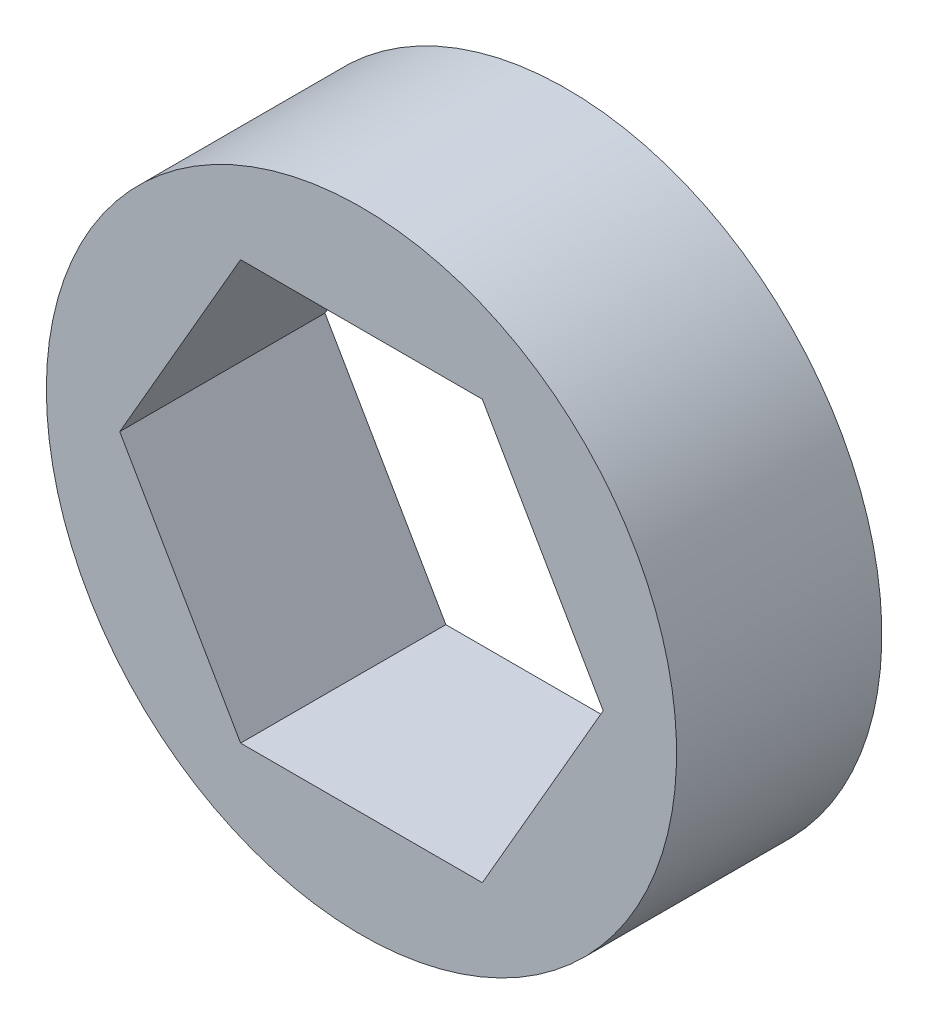
ISO-10303-21;
HEADER;
FILE_DESCRIPTION(('STEP AP214'),'2;1');
FILE_NAME('part.step','',(''),(''),'','','');
FILE_SCHEMA(('AUTOMOTIVE_DESIGN { 1 0 10303 214 1 1 1 1 }'));
ENDSEC;
DATA;
#1=APPLICATION_CONTEXT('core data for automotive mechanical design processes');
#2=APPLICATION_PROTOCOL_DEFINITION('international standard','automotive_design',2000,#1);
#3=PRODUCT_CONTEXT('',#1,'mechanical');
#4=PRODUCT('Part','Part','',(#3));
#5=PRODUCT_RELATED_PRODUCT_CATEGORY('part','',(#4));
#6=PRODUCT_DEFINITION_FORMATION('','',#4);
#7=PRODUCT_DEFINITION_CONTEXT('part definition',#1,'design');
#8=PRODUCT_DEFINITION('design','',#6,#7);
#9=PRODUCT_DEFINITION_SHAPE('','',#8);
#10=(LENGTH_UNIT() NAMED_UNIT(*) SI_UNIT(.MILLI.,.METRE.));
#11=(NAMED_UNIT(*) PLANE_ANGLE_UNIT() SI_UNIT($,.RADIAN.));
#12=(NAMED_UNIT(*) SI_UNIT($,.STERADIAN.) SOLID_ANGLE_UNIT());
#13=UNCERTAINTY_MEASURE_WITH_UNIT(LENGTH_MEASURE(1.E-05),#10,'distance_accuracy_value','');
#14=(GEOMETRIC_REPRESENTATION_CONTEXT(3) GLOBAL_UNCERTAINTY_ASSIGNED_CONTEXT((#13)) GLOBAL_UNIT_ASSIGNED_CONTEXT((#10,
#11,#12)) REPRESENTATION_CONTEXT('',''));
#15=CARTESIAN_POINT('',(0.,0.,0.));
#16=DIRECTION('',(0.,0.,1.));
#17=DIRECTION('',(1.,0.,0.));
#18=AXIS2_PLACEMENT_3D('',#15,#16,#17);
#19=CARTESIAN_POINT('',(-7.47899538708241,0.,3.175));
#20=DIRECTION('',(0.866025403784439,0.5,0.));
#21=DIRECTION('',(-0.5,0.866025403784439,0.));
#22=AXIS2_PLACEMENT_3D('',#19,#20,#21);
#23=PLANE('',#22);
#24=DIRECTION('',(-0.5,0.866025403784438,0.));
#25=VECTOR('',#24,1.);
#26=CARTESIAN_POINT('',(-3.73949769354121,-6.477,3.175));
#27=LINE('',#26,#25);
#28=CARTESIAN_POINT('',(-3.73949769354121,-6.477,3.175));
#29=VERTEX_POINT('',#28);
#30=CARTESIAN_POINT('',(-7.47899538708241,0.,3.175));
#31=VERTEX_POINT('',#30);
#32=EDGE_CURVE('E83',#29,#31,#27,.T.);
#33=ORIENTED_EDGE('',*,*,#32,.F.);
#34=DIRECTION('',(0.,0.,1.));
#35=VECTOR('',#34,1.);
#36=CARTESIAN_POINT('',(-3.73949769354121,-6.477,3.175));
#37=LINE('',#36,#35);
#38=CARTESIAN_POINT('',(-3.73949769354121,-6.477,-3.175));
#39=VERTEX_POINT('',#38);
#40=EDGE_CURVE('E75',#39,#29,#37,.T.);
#41=ORIENTED_EDGE('',*,*,#40,.F.);
#42=DIRECTION('',(-0.5,0.866025403784439,0.));
#43=VECTOR('',#42,1.);
#44=CARTESIAN_POINT('',(-3.73949769354121,-6.477,-3.175));
#45=LINE('',#44,#43);
#46=CARTESIAN_POINT('',(-7.47899538708241,0.,-3.175));
#47=VERTEX_POINT('',#46);
#48=EDGE_CURVE('E115',#39,#47,#45,.T.);
#49=ORIENTED_EDGE('',*,*,#48,.T.);
#50=DIRECTION('',(0.,0.,1.));
#51=VECTOR('',#50,1.);
#52=CARTESIAN_POINT('',(-7.47899538708241,0.,3.175));
#53=LINE('',#52,#51);
#54=EDGE_CURVE('E100',#31,#47,#53,.F.);
#55=ORIENTED_EDGE('',*,*,#54,.F.);
#56=EDGE_LOOP('',(#33,#41,#49,#55));
#57=FACE_BOUND('',#56,.T.);
#58=ADVANCED_FACE('F16',(#57),#23,.T.);
#59=CARTESIAN_POINT('',(-3.73949769354121,6.477,3.175));
#60=DIRECTION('',(0.866025403784439,-0.5,0.));
#61=DIRECTION('',(0.5,0.866025403784439,0.));
#62=AXIS2_PLACEMENT_3D('',#59,#60,#61);
#63=PLANE('',#62);
#64=DIRECTION('',(0.5,0.866025403784439,0.));
#65=VECTOR('',#64,1.);
#66=CARTESIAN_POINT('',(-7.47899538708242,0.,3.175));
#67=LINE('',#66,#65);
#68=CARTESIAN_POINT('',(-3.73949769354121,6.477,3.175));
#69=VERTEX_POINT('',#68);
#70=EDGE_CURVE('E108',#31,#69,#67,.T.);
#71=ORIENTED_EDGE('',*,*,#70,.F.);
#72=ORIENTED_EDGE('',*,*,#54,.T.);
#73=DIRECTION('',(0.5,0.866025403784439,0.));
#74=VECTOR('',#73,1.);
#75=CARTESIAN_POINT('',(-7.47899538708241,0.,-3.175));
#76=LINE('',#75,#74);
#77=CARTESIAN_POINT('',(-3.73949769354121,6.477,-3.175));
#78=VERTEX_POINT('',#77);
#79=EDGE_CURVE('E106',#47,#78,#76,.T.);
#80=ORIENTED_EDGE('',*,*,#79,.T.);
#81=DIRECTION('',(0.,0.,1.));
#82=VECTOR('',#81,1.);
#83=CARTESIAN_POINT('',(-3.73949769354121,6.477,3.175));
#84=LINE('',#83,#82);
#85=EDGE_CURVE('E97',#69,#78,#84,.F.);
#86=ORIENTED_EDGE('',*,*,#85,.F.);
#87=EDGE_LOOP('',(#71,#72,#80,#86));
#88=FACE_BOUND('',#87,.T.);
#89=ADVANCED_FACE('F105',(#88),#63,.T.);
#90=CARTESIAN_POINT('',(3.7394976935412,6.477,3.175));
#91=DIRECTION('',(0.,-1.,0.));
#92=DIRECTION('',(1.,0.,0.));
#93=AXIS2_PLACEMENT_3D('',#90,#91,#92);
#94=PLANE('',#93);
#95=DIRECTION('',(1.,0.,0.));
#96=VECTOR('',#95,1.);
#97=CARTESIAN_POINT('',(0.,6.477,3.175));
#98=LINE('',#97,#96);
#99=CARTESIAN_POINT('',(3.7394976935412,6.477,3.175));
#100=VERTEX_POINT('',#99);
#101=EDGE_CURVE('E125',#69,#100,#98,.T.);
#102=ORIENTED_EDGE('',*,*,#101,.F.);
#103=ORIENTED_EDGE('',*,*,#85,.T.);
#104=DIRECTION('',(1.,0.,0.));
#105=VECTOR('',#104,1.);
#106=CARTESIAN_POINT('',(0.,6.477,-3.175));
#107=LINE('',#106,#105);
#108=CARTESIAN_POINT('',(3.7394976935412,6.477,-3.175));
#109=VERTEX_POINT('',#108);
#110=EDGE_CURVE('E117',#78,#109,#107,.T.);
#111=ORIENTED_EDGE('',*,*,#110,.T.);
#112=DIRECTION('',(0.,0.,1.));
#113=VECTOR('',#112,1.);
#114=CARTESIAN_POINT('',(3.7394976935412,6.47700000000001,3.175));
#115=LINE('',#114,#113);
#116=EDGE_CURVE('E94',#100,#109,#115,.F.);
#117=ORIENTED_EDGE('',*,*,#116,.F.);
#118=EDGE_LOOP('',(#102,#103,#111,#117));
#119=FACE_BOUND('',#118,.T.);
#120=ADVANCED_FACE('F134',(#119),#94,.T.);
#121=CARTESIAN_POINT('',(7.47899538708241,0.,3.175));
#122=DIRECTION('',(-0.866025403784439,-0.5,0.));
#123=DIRECTION('',(0.5,-0.866025403784439,0.));
#124=AXIS2_PLACEMENT_3D('',#121,#122,#123);
#125=PLANE('',#124);
#126=DIRECTION('',(0.5,-0.866025403784438,0.));
#127=VECTOR('',#126,1.);
#128=CARTESIAN_POINT('',(3.7394976935412,6.477,3.175));
#129=LINE('',#128,#127);
#130=CARTESIAN_POINT('',(7.47899538708242,0.,3.175));
#131=VERTEX_POINT('',#130);
#132=EDGE_CURVE('E88',#100,#131,#129,.T.);
#133=ORIENTED_EDGE('',*,*,#132,.F.);
#134=ORIENTED_EDGE('',*,*,#116,.T.);
#135=DIRECTION('',(0.5,-0.866025403784438,0.));
#136=VECTOR('',#135,1.);
#137=CARTESIAN_POINT('',(3.7394976935412,6.477,-3.175));
#138=LINE('',#137,#136);
#139=CARTESIAN_POINT('',(7.47899538708241,0.,-3.175));
#140=VERTEX_POINT('',#139);
#141=EDGE_CURVE('E119',#109,#140,#138,.T.);
#142=ORIENTED_EDGE('',*,*,#141,.T.);
#143=DIRECTION('',(0.,0.,1.));
#144=VECTOR('',#143,1.);
#145=CARTESIAN_POINT('',(7.47899538708242,0.,3.175));
#146=LINE('',#145,#144);
#147=EDGE_CURVE('E64',#131,#140,#146,.F.);
#148=ORIENTED_EDGE('',*,*,#147,.F.);
#149=EDGE_LOOP('',(#133,#134,#142,#148));
#150=FACE_BOUND('',#149,.T.);
#151=ADVANCED_FACE('F131',(#150),#125,.T.);
#152=CARTESIAN_POINT('',(3.73949769354121,-6.477,3.175));
#153=DIRECTION('',(-0.866025403784439,0.5,0.));
#154=DIRECTION('',(-0.5,-0.866025403784439,0.));
#155=AXIS2_PLACEMENT_3D('',#152,#153,#154);
#156=PLANE('',#155);
#157=DIRECTION('',(-0.5,-0.866025403784439,0.));
#158=VECTOR('',#157,1.);
#159=CARTESIAN_POINT('',(7.47899538708241,0.,3.175));
#160=LINE('',#159,#158);
#161=CARTESIAN_POINT('',(3.73949769354121,-6.477,3.175));
#162=VERTEX_POINT('',#161);
#163=EDGE_CURVE('E70',#131,#162,#160,.T.);
#164=ORIENTED_EDGE('',*,*,#163,.F.);
#165=ORIENTED_EDGE('',*,*,#147,.T.);
#166=DIRECTION('',(-0.5,-0.866025403784439,0.));
#167=VECTOR('',#166,1.);
#168=CARTESIAN_POINT('',(7.47899538708241,0.,-3.175));
#169=LINE('',#168,#167);
#170=CARTESIAN_POINT('',(3.73949769354121,-6.477,-3.175));
#171=VERTEX_POINT('',#170);
#172=EDGE_CURVE('E32',#140,#171,#169,.T.);
#173=ORIENTED_EDGE('',*,*,#172,.T.);
#174=DIRECTION('',(0.,0.,1.));
#175=VECTOR('',#174,1.);
#176=CARTESIAN_POINT('',(3.73949769354121,-6.477,3.175));
#177=LINE('',#176,#175);
#178=EDGE_CURVE('E66',#162,#171,#177,.F.);
#179=ORIENTED_EDGE('',*,*,#178,.F.);
#180=EDGE_LOOP('',(#164,#165,#173,#179));
#181=FACE_BOUND('',#180,.T.);
#182=ADVANCED_FACE('F68',(#181),#156,.T.);
#183=CARTESIAN_POINT('',(-3.73949769354121,-6.477,3.175));
#184=DIRECTION('',(0.,1.,0.));
#185=DIRECTION('',(0.,0.,1.));
#186=AXIS2_PLACEMENT_3D('',#183,#184,#185);
#187=PLANE('',#186);
#188=DIRECTION('',(1.,0.,0.));
#189=VECTOR('',#188,1.);
#190=CARTESIAN_POINT('',(0.,-6.477,3.175));
#191=LINE('',#190,#189);
#192=EDGE_CURVE('E78',#162,#29,#191,.F.);
#193=ORIENTED_EDGE('',*,*,#192,.F.);
#194=ORIENTED_EDGE('',*,*,#178,.T.);
#195=DIRECTION('',(1.,0.,0.));
#196=VECTOR('',#195,1.);
#197=CARTESIAN_POINT('',(0.,-6.477,-3.175));
#198=LINE('',#197,#196);
#199=EDGE_CURVE('E127',#171,#39,#198,.F.);
#200=ORIENTED_EDGE('',*,*,#199,.T.);
#201=ORIENTED_EDGE('',*,*,#40,.T.);
#202=EDGE_LOOP('',(#193,#194,#200,#201));
#203=FACE_BOUND('',#202,.T.);
#204=ADVANCED_FACE('F79',(#203),#187,.T.);
#205=CARTESIAN_POINT('',(0.,0.,3.175));
#206=DIRECTION('',(0.,0.,1.));
#207=DIRECTION('',(1.,0.,0.));
#208=AXIS2_PLACEMENT_3D('',#205,#206,#207);
#209=PLANE('',#208);
#210=ORIENTED_EDGE('',*,*,#101,.T.);
#211=ORIENTED_EDGE('',*,*,#132,.T.);
#212=ORIENTED_EDGE('',*,*,#163,.T.);
#213=ORIENTED_EDGE('',*,*,#192,.T.);
#214=ORIENTED_EDGE('',*,*,#32,.T.);
#215=ORIENTED_EDGE('',*,*,#70,.T.);
#216=EDGE_LOOP('',(#210,#211,#212,#213,#214,#215));
#217=FACE_BOUND('',#216,.T.);
#218=CARTESIAN_POINT('',(0.,0.,3.175));
#219=DIRECTION('',(0.,0.,-1.));
#220=DIRECTION('',(-1.,0.,0.));
#221=AXIS2_PLACEMENT_3D('',#218,#219,#220);
#222=CIRCLE('',#221,9.75);
#223=CARTESIAN_POINT('',(-9.75,0.,3.175));
#224=VERTEX_POINT('',#223);
#225=EDGE_CURVE('E19',#224,#224,#222,.T.);
#226=ORIENTED_EDGE('',*,*,#225,.F.);
#227=EDGE_LOOP('',(#226));
#228=FACE_BOUND('',#227,.T.);
#229=ADVANCED_FACE('F86',(#217,#228),#209,.T.);
#230=CARTESIAN_POINT('',(0.,0.,-3.175));
#231=DIRECTION('',(0.,0.,1.));
#232=DIRECTION('',(1.,0.,0.));
#233=AXIS2_PLACEMENT_3D('',#230,#231,#232);
#234=PLANE('',#233);
#235=ORIENTED_EDGE('',*,*,#172,.F.);
#236=ORIENTED_EDGE('',*,*,#141,.F.);
#237=ORIENTED_EDGE('',*,*,#110,.F.);
#238=ORIENTED_EDGE('',*,*,#79,.F.);
#239=ORIENTED_EDGE('',*,*,#48,.F.);
#240=ORIENTED_EDGE('',*,*,#199,.F.);
#241=EDGE_LOOP('',(#235,#236,#237,#238,#239,#240));
#242=FACE_BOUND('',#241,.T.);
#243=CARTESIAN_POINT('',(0.,0.,-3.175));
#244=DIRECTION('',(0.,0.,-1.));
#245=DIRECTION('',(-1.,0.,0.));
#246=AXIS2_PLACEMENT_3D('',#243,#244,#245);
#247=CIRCLE('',#246,9.75);
#248=CARTESIAN_POINT('',(-9.75,0.,-3.175));
#249=VERTEX_POINT('',#248);
#250=EDGE_CURVE('E11',#249,#249,#247,.F.);
#251=ORIENTED_EDGE('',*,*,#250,.F.);
#252=EDGE_LOOP('',(#251));
#253=FACE_BOUND('',#252,.T.);
#254=ADVANCED_FACE('F113',(#242,#253),#234,.F.);
#255=CARTESIAN_POINT('',(0.,0.,3.175));
#256=DIRECTION('',(0.,0.,-1.));
#257=DIRECTION('',(-1.,0.,0.));
#258=AXIS2_PLACEMENT_3D('',#255,#256,#257);
#259=CYLINDRICAL_SURFACE('',#258,9.75);
#260=ORIENTED_EDGE('',*,*,#250,.T.);
#261=EDGE_LOOP('',(#260));
#262=FACE_BOUND('',#261,.T.);
#263=ORIENTED_EDGE('',*,*,#225,.T.);
#264=EDGE_LOOP('',(#263));
#265=FACE_BOUND('',#264,.T.);
#266=ADVANCED_FACE('F143',(#262,#265),#259,.T.);
#267=CLOSED_SHELL('',(#58,#89,#120,#151,#182,#204,#229,#254,#266));
#268=MANIFOLD_SOLID_BREP('B1',#267);
#269=ADVANCED_BREP_SHAPE_REPRESENTATION('',(#18,#268),#14);
#270=SHAPE_DEFINITION_REPRESENTATION(#9,#269);
ENDSEC;
END-ISO-10303-21;
